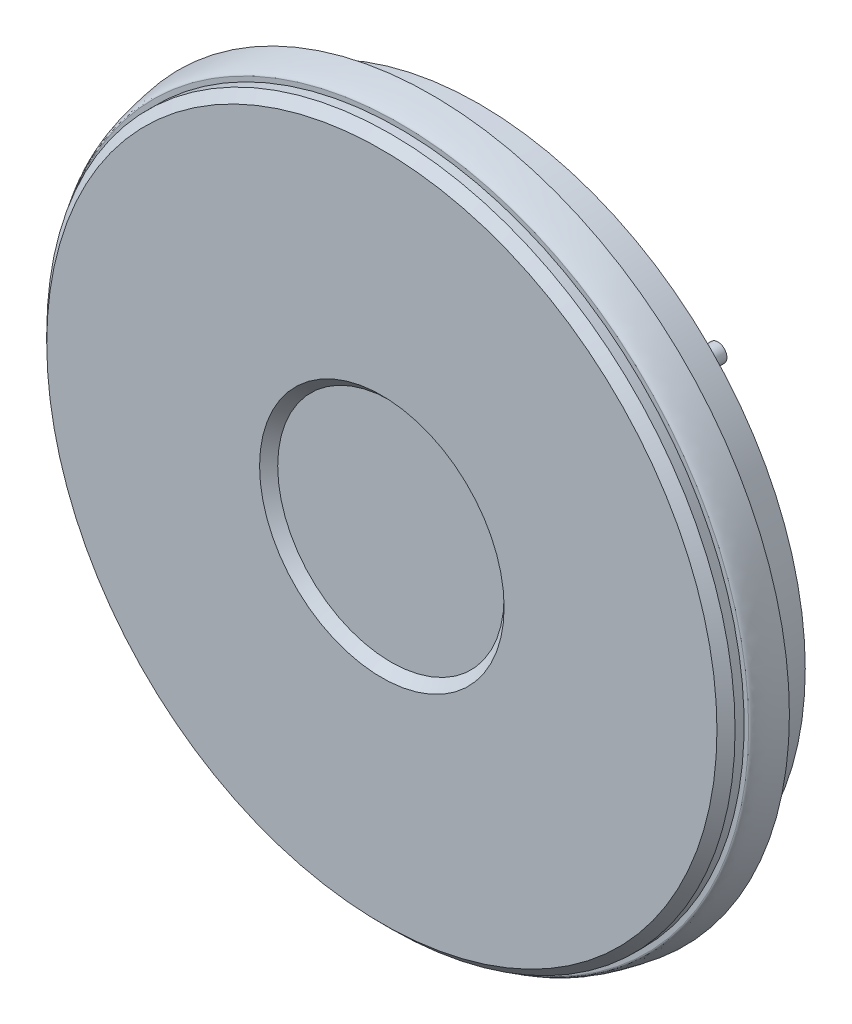
ISO-10303-21;
HEADER;
FILE_DESCRIPTION(('STEP AP214'),'2;1');
FILE_NAME('part.step','',(''),(''),'','','');
FILE_SCHEMA(('AUTOMOTIVE_DESIGN { 1 0 10303 214 1 1 1 1 }'));
ENDSEC;
DATA;
#1=APPLICATION_CONTEXT('core data for automotive mechanical design processes');
#2=APPLICATION_PROTOCOL_DEFINITION('international standard','automotive_design',2000,#1);
#3=PRODUCT_CONTEXT('',#1,'mechanical');
#4=PRODUCT('Part','Part','',(#3));
#5=PRODUCT_RELATED_PRODUCT_CATEGORY('part','',(#4));
#6=PRODUCT_DEFINITION_FORMATION('','',#4);
#7=PRODUCT_DEFINITION_CONTEXT('part definition',#1,'design');
#8=PRODUCT_DEFINITION('design','',#6,#7);
#9=PRODUCT_DEFINITION_SHAPE('','',#8);
#10=(LENGTH_UNIT() NAMED_UNIT(*) SI_UNIT(.MILLI.,.METRE.));
#11=(NAMED_UNIT(*) PLANE_ANGLE_UNIT() SI_UNIT($,.RADIAN.));
#12=(NAMED_UNIT(*) SI_UNIT($,.STERADIAN.) SOLID_ANGLE_UNIT());
#13=UNCERTAINTY_MEASURE_WITH_UNIT(LENGTH_MEASURE(1.E-05),#10,'distance_accuracy_value','');
#14=(GEOMETRIC_REPRESENTATION_CONTEXT(3) GLOBAL_UNCERTAINTY_ASSIGNED_CONTEXT((#13)) GLOBAL_UNIT_ASSIGNED_CONTEXT((#10,
#11,#12)) REPRESENTATION_CONTEXT('',''));
#15=CARTESIAN_POINT('',(0.,0.,0.));
#16=DIRECTION('',(0.,0.,1.));
#17=DIRECTION('',(1.,0.,0.));
#18=AXIS2_PLACEMENT_3D('',#15,#16,#17);
#19=CARTESIAN_POINT('',(0.,0.,-19.));
#20=DIRECTION('',(0.,0.,1.));
#21=DIRECTION('',(1.,0.,0.));
#22=AXIS2_PLACEMENT_3D('',#19,#20,#21);
#23=CONICAL_SURFACE('',#22,32.,1.38381705687599);
#24=CARTESIAN_POINT('',(0.,0.,-15.5));
#25=DIRECTION('',(0.,0.,1.));
#26=DIRECTION('',(1.,0.,0.));
#27=AXIS2_PLACEMENT_3D('',#24,#25,#26);
#28=CIRCLE('',#27,50.5);
#29=CARTESIAN_POINT('',(50.5,0.,-15.5));
#30=VERTEX_POINT('',#29);
#31=EDGE_CURVE('E120',#30,#30,#28,.T.);
#32=ORIENTED_EDGE('',*,*,#31,.F.);
#33=EDGE_LOOP('',(#32));
#34=FACE_BOUND('',#33,.T.);
#35=CARTESIAN_POINT('',(0.,0.,-19.));
#36=DIRECTION('',(0.,0.,1.));
#37=DIRECTION('',(1.,0.,0.));
#38=AXIS2_PLACEMENT_3D('',#35,#36,#37);
#39=CIRCLE('',#38,32.);
#40=CARTESIAN_POINT('',(32.,0.,-19.));
#41=VERTEX_POINT('',#40);
#42=EDGE_CURVE('E124',#41,#41,#39,.T.);
#43=ORIENTED_EDGE('',*,*,#42,.T.);
#44=EDGE_LOOP('',(#43));
#45=FACE_BOUND('',#44,.T.);
#46=CARTESIAN_POINT('',(27.7866084402661,25.9228494342572,-17.8646405768955));
#47=CARTESIAN_POINT('',(27.7083190812098,26.0010547407988,-17.8653774780036));
#48=CARTESIAN_POINT('',(27.6364715657968,26.0858409020205,-17.864282894545));
#49=CARTESIAN_POINT('',(27.5077822164449,26.266115598641,-17.858458398402));
#50=CARTESIAN_POINT('',(27.4509584465608,26.361616822822,-17.853724135962));
#51=CARTESIAN_POINT('',(27.3539841248708,26.5604267184576,-17.8407942703781));
#52=CARTESIAN_POINT('',(27.3138194338437,26.6637286807163,-17.8326016144773));
#53=CARTESIAN_POINT('',(27.2511243996395,26.8752297420599,-17.8130439344785));
#54=CARTESIAN_POINT('',(27.2285903748789,26.9834278137593,-17.8016795733594));
#55=CARTESIAN_POINT('',(27.2015031185621,27.2026059976347,-17.7760566879188));
#56=CARTESIAN_POINT('',(27.1970959486618,27.3136014855602,-17.7617756233053));
#57=CARTESIAN_POINT('',(27.2066166832189,27.5344700622705,-17.7308401857691));
#58=CARTESIAN_POINT('',(27.2205467481418,27.644343017263,-17.7141855333999));
#59=CARTESIAN_POINT('',(27.2666190527725,27.8619298269741,-17.678703328111));
#60=CARTESIAN_POINT('',(27.2990803020663,27.9695706955524,-17.6598424416512));
#61=CARTESIAN_POINT('',(27.3814209090786,28.1777065139437,-17.6207641323911));
#62=CARTESIAN_POINT('',(27.431301878724,28.2782008014145,-17.6005465841927));
#63=CARTESIAN_POINT('',(27.5479951482473,28.4709242398635,-17.5589979387498));
#64=CARTESIAN_POINT('',(27.6150725031688,28.5629902106871,-17.5376539935875));
#65=CARTESIAN_POINT('',(27.7638250314128,28.7344106329288,-17.4947768073707));
#66=CARTESIAN_POINT('',(27.8455010278453,28.8137643671188,-17.4732435557078));
#67=CARTESIAN_POINT('',(28.0218833542666,28.9581110631356,-17.430415230631));
#68=CARTESIAN_POINT('',(28.1166884553569,29.0229843857812,-17.4091234286395));
#69=CARTESIAN_POINT('',(28.3161622184946,29.1356486132857,-17.3675461252375));
#70=CARTESIAN_POINT('',(28.4208308780927,29.1834395223864,-17.3472606235772));
#71=CARTESIAN_POINT('',(28.636696277713,29.2603244897728,-17.3083232205729));
#72=CARTESIAN_POINT('',(28.7478692643724,29.2894824470505,-17.289665927709));
#73=CARTESIAN_POINT('',(28.9738855523762,29.3283677249349,-17.254421996244));
#74=CARTESIAN_POINT('',(29.0887286289065,29.3380962333982,-17.2378352311153));
#75=CARTESIAN_POINT('',(29.3172535121522,29.3376711586197,-17.2073909369241));
#76=CARTESIAN_POINT('',(29.4309314781242,29.3277692432189,-17.1935013355433));
#77=CARTESIAN_POINT('',(29.6552533904552,29.2887066495129,-17.1685774185538));
#78=CARTESIAN_POINT('',(29.7658976128995,29.2595477297878,-17.1575428423477));
#79=CARTESIAN_POINT('',(29.9790969723618,29.1833173019861,-17.1387933024743));
#80=CARTESIAN_POINT('',(30.081754037906,29.1365433072969,-17.1310275077409));
#81=CARTESIAN_POINT('',(30.2778977970352,29.0263137064449,-17.1187765613196));
#82=CARTESIAN_POINT('',(30.3713852345275,28.962859455046,-17.1142911433128));
#83=CARTESIAN_POINT('',(30.5452906629787,28.8219866812874,-17.1087623057145));
#84=CARTESIAN_POINT('',(30.6258609961733,28.7447578388738,-17.1076754480019));
#85=CARTESIAN_POINT('',(30.7730432459844,28.5780070259041,-17.1088506655149));
#86=CARTESIAN_POINT('',(30.8396557086932,28.4884855365165,-17.1111126096929));
#87=CARTESIAN_POINT('',(30.9567787809856,28.3001592247567,-17.1189052198412));
#88=CARTESIAN_POINT('',(31.0073604105273,28.2013979319644,-17.1244211497429));
#89=CARTESIAN_POINT('',(31.0914742593614,27.9970758987128,-17.138560126196));
#90=CARTESIAN_POINT('',(31.1250062414346,27.8915150636718,-17.1471832159759));
#91=CARTESIAN_POINT('',(31.1743271734831,27.6759960018385,-17.1673605804866));
#92=CARTESIAN_POINT('',(31.1900192926231,27.5660170999685,-17.178930438542));
#93=CARTESIAN_POINT('',(31.2030404694301,27.3452831324801,-17.204670893327));
#94=CARTESIAN_POINT('',(31.2003684306001,27.2345280209098,-17.218841645303));
#95=CARTESIAN_POINT('',(31.1767308459126,27.0138287475487,-17.2496165850547));
#96=CARTESIAN_POINT('',(31.1555246180017,26.9039145213503,-17.2662503881512));
#97=CARTESIAN_POINT('',(31.0952318507962,26.6894178796245,-17.3013713280528));
#98=CARTESIAN_POINT('',(31.0561438467192,26.5848359016677,-17.3198586165888));
#99=CARTESIAN_POINT('',(30.9605172484765,26.3822035252899,-17.3585128407818));
#100=CARTESIAN_POINT('',(30.9037097272945,26.2842842369309,-17.3787018995116));
#101=CARTESIAN_POINT('',(30.7745340144613,26.0995192192322,-17.4199572540222));
#102=CARTESIAN_POINT('',(30.7021645904359,26.0126743677647,-17.4410236191717));
#103=CARTESIAN_POINT('',(30.5429149967131,25.8514208503295,-17.4837307198298));
#104=CARTESIAN_POINT('',(30.4558654451106,25.7771804077686,-17.5053753406767));
#105=CARTESIAN_POINT('',(30.2703536753633,25.644562211581,-17.5483731259446));
#106=CARTESIAN_POINT('',(30.1718910114437,25.5861850778435,-17.569726278945));
#107=CARTESIAN_POINT('',(29.9659592594109,25.486826944053,-17.6115902807364));
#108=CARTESIAN_POINT('',(29.858461383683,25.4459042821164,-17.6320981010623));
#109=CARTESIAN_POINT('',(29.6377850170175,25.3830187592457,-17.6715688113388));
#110=CARTESIAN_POINT('',(29.5246069000162,25.3610546519783,-17.690531802772));
#111=CARTESIAN_POINT('',(29.296774904406,25.3369740850483,-17.726155538021));
#112=CARTESIAN_POINT('',(29.1821411816122,25.3346937639793,-17.7428341493018));
#113=CARTESIAN_POINT('',(28.9537796911399,25.349804578365,-17.7735204883676));
#114=CARTESIAN_POINT('',(28.8400520749999,25.3671989374702,-17.7875277780232));
#115=CARTESIAN_POINT('',(28.6187707688265,25.420875547504,-17.8121687081356));
#116=CARTESIAN_POINT('',(28.5111464578844,25.4568437031204,-17.822853857439));
#117=CARTESIAN_POINT('',(28.3033829493614,25.5465603942486,-17.8407643720016));
#118=CARTESIAN_POINT('',(28.2032337847799,25.6002847159501,-17.8479944162732));
#119=CARTESIAN_POINT('',(28.050429068569,25.6998142783417,-17.8566485680416));
#120=CARTESIAN_POINT('',(27.9944712400197,25.7405503245862,-17.8592372321324));
#121=CARTESIAN_POINT('',(27.8870388172195,25.8276163437418,-17.8630028304474));
#122=CARTESIAN_POINT('',(27.8355641760122,25.873946258051,-17.8641797794594));
#123=CARTESIAN_POINT('',(27.7866084402661,25.9228494342572,-17.8646405768955));
#124=B_SPLINE_CURVE_WITH_KNOTS('',3,(#46,#47,#48,#49,#50,#51,#52,#53,#54,#55,#56,#57,#58,#59,
#60,#61,#62,#63,#64,#65,#66,#67,#68,#69,#70,#71,#72,#73,#74,#75,#76,#77,#78,#79,#80,#81,#82,#83,
#84,#85,#86,#87,#88,#89,#90,#91,#92,#93,#94,#95,#96,#97,#98,#99,#100,#101,#102,#103,#104,#105,
#106,#107,#108,#109,#110,#111,#112,#113,#114,#115,#116,#117,#118,#119,#120,#121,#122,#123),
.UNSPECIFIED.,.T.,.F.,(4,2,2,2,2,2,2,2,2,2,2,2,2,2,2,2,2,2,2,2,2,2,2,2,2,2,2,2,2,2,2,2,2,2,2,2,
2,2,4),(0.,0.33172792330212,0.663852909851376,0.995695429053667,1.32746863537738,
1.66191001168749,1.99639079490754,2.33681111011882,2.67726293433675,3.0233159164112,
3.36938841602609,3.71822228497298,4.06705606729761,4.41468706271699,4.76229680439685,
5.10547890082227,5.44862966165093,5.78622725820314,6.12379744367805,6.45703501863238,
6.79025955345667,7.12198650117742,7.45371806423288,7.78724172289057,8.1207852959304,
8.45872566507467,8.79669372150201,9.14006351118342,9.4834605029376,9.83113118126698,
10.1788154435415,10.5276528346698,10.876467291521,11.2223751469364,11.5683396867598,
11.9086365333377,12.2484712239982,12.4559087974707,12.663344197997),.UNSPECIFIED.);
#125=CARTESIAN_POINT('',(27.7866084402661,25.9228494342572,-17.8646405768955));
#126=VERTEX_POINT('',#125);
#127=EDGE_CURVE('E58',#126,#126,#124,.T.);
#128=ORIENTED_EDGE('',*,*,#127,.F.);
#129=EDGE_LOOP('',(#128));
#130=FACE_BOUND('',#129,.T.);
#131=CARTESIAN_POINT('',(-30.5852798871474,25.8953187703622,-17.4722471263461));
#132=CARTESIAN_POINT('',(-30.6672718955883,25.97406134797,-17.4507823975966));
#133=CARTESIAN_POINT('',(-30.742610480517,26.0598800699168,-17.4294134516743));
#134=CARTESIAN_POINT('',(-30.8777458934135,26.2432759110166,-17.3874692878005));
#135=CARTESIAN_POINT('',(-30.937524199534,26.3408668426802,-17.3668950403737));
#136=CARTESIAN_POINT('',(-31.0396780299534,26.5450376640024,-17.32712039879));
#137=CARTESIAN_POINT('',(-31.0820543179401,26.6516171589502,-17.3079199443749));
#138=CARTESIAN_POINT('',(-31.1480355584359,26.8707197698036,-17.2714263012497));
#139=CARTESIAN_POINT('',(-31.1716458118558,26.9832411976853,-17.2541325751289));
#140=CARTESIAN_POINT('',(-31.1991433555308,27.2100012169761,-17.2220673808807));
#141=CARTESIAN_POINT('',(-31.2032023462947,27.3242159900423,-17.2072750599217));
#142=CARTESIAN_POINT('',(-31.1917724558806,27.5519959502675,-17.1804391353673));
#143=CARTESIAN_POINT('',(-31.1762844415918,27.6655611660092,-17.1683954099026));
#144=CARTESIAN_POINT('',(-31.1264706346823,27.8868552634448,-17.1475659721806));
#145=CARTESIAN_POINT('',(-31.0924520287164,27.9946486597728,-17.1387309450171));
#146=CARTESIAN_POINT('',(-31.006659196509,28.2031532100949,-17.1242968397996));
#147=CARTESIAN_POINT('',(-30.9548865469899,28.3038649920447,-17.1186974745074));
#148=CARTESIAN_POINT('',(-30.8358643519541,28.4938893419225,-17.1109458197951));
#149=CARTESIAN_POINT('',(-30.7688383319747,28.5833400826795,-17.1087470105581));
#150=CARTESIAN_POINT('',(-30.6208291536162,28.7498528845586,-17.1077098721091));
#151=CARTESIAN_POINT('',(-30.539846678661,28.8269155519466,-17.1088713783921));
#152=CARTESIAN_POINT('',(-30.366795462762,28.9660255359598,-17.1145051264063));
#153=CARTESIAN_POINT('',(-30.274797122501,29.028161300168,-17.1189571952254));
#154=CARTESIAN_POINT('',(-30.081964550566,29.1363183345191,-17.1310275887905));
#155=CARTESIAN_POINT('',(-29.9811302628387,29.1823395024251,-17.1386459336236));
#156=CARTESIAN_POINT('',(-29.77309954829,29.2572150077117,-17.1568790892304));
#157=CARTESIAN_POINT('',(-29.6658802824641,29.2860030741611,-17.1675052390371));
#158=CARTESIAN_POINT('',(-29.4484559650283,29.3254671578164,-17.1914588538452));
#159=CARTESIAN_POINT('',(-29.3382507566234,29.3361422220088,-17.2047864609421));
#160=CARTESIAN_POINT('',(-29.1165546105105,29.3392541296224,-17.2339717140859));
#161=CARTESIAN_POINT('',(-29.0050643607006,29.3314672627377,-17.249858197049));
#162=CARTESIAN_POINT('',(-28.7852196582652,29.2975620342683,-17.2836240674355));
#163=CARTESIAN_POINT('',(-28.6768654608675,29.2714421849963,-17.3015036164935));
#164=CARTESIAN_POINT('',(-28.4645354724592,29.2011611831812,-17.3390894110889));
#165=CARTESIAN_POINT('',(-28.360657033659,29.1567190243272,-17.3588202359826));
#166=CARTESIAN_POINT('',(-28.1619940270091,29.0511285879981,-17.3993351207904));
#167=CARTESIAN_POINT('',(-28.0672101901801,28.9899789691011,-17.420119265165));
#168=CARTESIAN_POINT('',(-27.8881060805226,28.8517875318501,-17.4624696004558));
#169=CARTESIAN_POINT('',(-27.8039439078648,28.7745427862472,-17.4840425537332));
#170=CARTESIAN_POINT('',(-27.6499506424541,28.6068641692175,-17.5270998337723));
#171=CARTESIAN_POINT('',(-27.5801202181297,28.5164296829615,-17.5485841563546));
#172=CARTESIAN_POINT('',(-27.4564695361268,28.3243989238345,-17.5909570710969));
#173=CARTESIAN_POINT('',(-27.4027325832986,28.2227481780492,-17.6118420741797));
#174=CARTESIAN_POINT('',(-27.3133721415553,28.0115212885549,-17.6522729780317));
#175=CARTESIAN_POINT('',(-27.2777483661682,27.9019452702206,-17.6718188999752));
#176=CARTESIAN_POINT('',(-27.2259455517807,27.6787017086687,-17.7088361859885));
#177=CARTESIAN_POINT('',(-27.2096441459022,27.5650646601023,-17.726319967016));
#178=CARTESIAN_POINT('',(-27.1967234831607,27.3363183006446,-17.7587797692949));
#179=CARTESIAN_POINT('',(-27.2001026173904,27.2212091108703,-17.7737559954389));
#180=CARTESIAN_POINT('',(-27.2264144958607,26.9947396473001,-17.8004661580753));
#181=CARTESIAN_POINT('',(-27.2490359199289,26.8833488685147,-17.8122477994154));
#182=CARTESIAN_POINT('',(-27.3129229488535,26.6657283287747,-17.8324599821448));
#183=CARTESIAN_POINT('',(-27.3541864660022,26.559497991383,-17.8408908985795));
#184=CARTESIAN_POINT('',(-27.4533373273899,26.3572628249284,-17.8539704329485));
#185=CARTESIAN_POINT('',(-27.510907746629,26.2611068328359,-17.8586852308681));
#186=CARTESIAN_POINT('',(-27.6413474682249,26.0796800106141,-17.8644129273951));
#187=CARTESIAN_POINT('',(-27.7142155681495,25.9944083258002,-17.865426116842));
#188=CARTESIAN_POINT('',(-27.872219820682,25.8381510418601,-17.8637236000176));
#189=CARTESIAN_POINT('',(-27.9572050145604,25.7670122184449,-17.8610507056449));
#190=CARTESIAN_POINT('',(-28.1376138526129,25.6397931920429,-17.852148976904));
#191=CARTESIAN_POINT('',(-28.2330374026161,25.5837128532196,-17.8459201746138));
#192=CARTESIAN_POINT('',(-28.4316856914452,25.4880590134438,-17.8301194210387));
#193=CARTESIAN_POINT('',(-28.5349183392334,25.4485025193269,-17.8205440438786));
#194=CARTESIAN_POINT('',(-28.7461749616846,25.3869503695901,-17.7983806956602));
#195=CARTESIAN_POINT('',(-28.8541990071977,25.364954973736,-17.7857926800422));
#196=CARTESIAN_POINT('',(-29.0734423419214,25.3388046355392,-17.7578404869086));
#197=CARTESIAN_POINT('',(-29.1846847873333,25.3348798066266,-17.7424430835216));
#198=CARTESIAN_POINT('',(-29.4059942070936,25.3454391873532,-17.7094697629773));
#199=CARTESIAN_POINT('',(-29.5160607747794,25.3599295702888,-17.6918931170597));
#200=CARTESIAN_POINT('',(-29.7340430706281,25.4072197843335,-17.654755621579));
#201=CARTESIAN_POINT('',(-29.8418803069002,25.4403563166076,-17.6351638599838));
#202=CARTESIAN_POINT('',(-30.0502060708383,25.5241246341899,-17.5948769874392));
#203=CARTESIAN_POINT('',(-30.150702407409,25.5747374907122,-17.5741830906499));
#204=CARTESIAN_POINT('',(-30.3071876818782,25.670770551937,-17.5398510252229));
#205=CARTESIAN_POINT('',(-30.3661553157224,25.7114786764563,-17.5263602519319));
#206=CARTESIAN_POINT('',(-30.479387925406,25.7989622521944,-17.4993160366215));
#207=CARTESIAN_POINT('',(-30.5336528507552,25.8457377685417,-17.4857625939309));
#208=CARTESIAN_POINT('',(-30.5852798871474,25.8953187703622,-17.4722471263461));
#209=B_SPLINE_CURVE_WITH_KNOTS('',3,(#131,#132,#133,#134,#135,#136,#137,#138,#139,#140,#141,
#142,#143,#144,#145,#146,#147,#148,#149,#150,#151,#152,#153,#154,#155,#156,#157,#158,#159,#160,
#161,#162,#163,#164,#165,#166,#167,#168,#169,#170,#171,#172,#173,#174,#175,#176,#177,#178,#179,
#180,#181,#182,#183,#184,#185,#186,#187,#188,#189,#190,#191,#192,#193,#194,#195,#196,#197,#198,
#199,#200,#201,#202,#203,#204,#205,#206,#207,#208),.UNSPECIFIED.,.T.,.F.,(4,2,2,2,2,2,2,2,2,2,2,
2,2,2,2,2,2,2,2,2,2,2,2,2,2,2,2,2,2,2,2,2,2,2,2,2,2,2,4),(0.,0.34680225552352,0.694015451272868,
1.0412134079406,1.38831325543411,1.7323592209238,2.07638992887026,2.41488381027249,
2.75334763808617,3.08713896757835,3.42091395652258,3.75265952288582,4.08440719392534,
4.41742255918689,4.750455445472,5.0875444041583,5.42466072014663,5.76715193499087,
6.10967065612856,6.45680200713026,6.80394954455792,7.15286414451347,7.50177322598297,
7.84846068606868,8.19511980444472,8.53627473923053,8.8773914779142,9.21228665896599,
9.54715552634944,9.87816765500918,10.2091767976453,10.5405257903614,10.8718796843405,
11.2074416292961,11.5431160937211,11.8850559882718,12.2266266799598,12.4449916255795,
12.6633589153587),.UNSPECIFIED.);
#210=CARTESIAN_POINT('',(-30.5852798871474,25.8953187703622,-17.4722471263461));
#211=VERTEX_POINT('',#210);
#212=EDGE_CURVE('E13',#211,#211,#209,.T.);
#213=ORIENTED_EDGE('',*,*,#212,.F.);
#214=EDGE_LOOP('',(#213));
#215=FACE_BOUND('',#214,.T.);
#216=ADVANCED_FACE('F47',(#34,#45,#130,#215),#23,.T.);
#217=CARTESIAN_POINT('',(0.,0.,4.));
#218=DIRECTION('',(0.,0.,-1.));
#219=DIRECTION('',(-1.,0.,0.));
#220=AXIS2_PLACEMENT_3D('',#217,#218,#219);
#221=CYLINDRICAL_SURFACE('',#220,76.);
#222=CARTESIAN_POINT('',(0.,0.,1.99999999999997));
#223=DIRECTION('',(0.,0.,1.));
#224=DIRECTION('',(1.,0.,0.));
#225=AXIS2_PLACEMENT_3D('',#222,#223,#224);
#226=CIRCLE('',#225,76.);
#227=CARTESIAN_POINT('',(76.,0.,1.99999999999997));
#228=VERTEX_POINT('',#227);
#229=EDGE_CURVE('E66',#228,#228,#226,.F.);
#230=ORIENTED_EDGE('',*,*,#229,.T.);
#231=EDGE_LOOP('',(#230));
#232=FACE_BOUND('',#231,.T.);
#233=CARTESIAN_POINT('',(0.,0.,0.));
#234=DIRECTION('',(0.,0.,-1.));
#235=DIRECTION('',(-1.,0.,0.));
#236=AXIS2_PLACEMENT_3D('',#233,#234,#235);
#237=CIRCLE('',#236,76.);
#238=CARTESIAN_POINT('',(-76.,0.,0.));
#239=VERTEX_POINT('',#238);
#240=EDGE_CURVE('E158',#239,#239,#237,.T.);
#241=ORIENTED_EDGE('',*,*,#240,.F.);
#242=EDGE_LOOP('',(#241));
#243=FACE_BOUND('',#242,.T.);
#244=ADVANCED_FACE('F109',(#232,#243),#221,.T.);
#245=CARTESIAN_POINT('',(0.,0.,4.));
#246=DIRECTION('',(0.,0.,1.));
#247=DIRECTION('',(1.,0.,0.));
#248=AXIS2_PLACEMENT_3D('',#245,#246,#247);
#249=PLANE('',#248);
#250=CARTESIAN_POINT('',(0.,0.,4.));
#251=DIRECTION('',(0.,0.,1.));
#252=DIRECTION('',(1.,0.,0.));
#253=AXIS2_PLACEMENT_3D('',#250,#251,#252);
#254=CIRCLE('',#253,27.);
#255=CARTESIAN_POINT('',(27.,0.,4.));
#256=VERTEX_POINT('',#255);
#257=EDGE_CURVE('E62',#256,#256,#254,.F.);
#258=ORIENTED_EDGE('',*,*,#257,.T.);
#259=EDGE_LOOP('',(#258));
#260=FACE_BOUND('',#259,.T.);
#261=CARTESIAN_POINT('',(0.,0.,4.));
#262=DIRECTION('',(0.,0.,1.));
#263=DIRECTION('',(1.,0.,0.));
#264=AXIS2_PLACEMENT_3D('',#261,#262,#263);
#265=CIRCLE('',#264,74.);
#266=CARTESIAN_POINT('',(74.,0.,4.));
#267=VERTEX_POINT('',#266);
#268=EDGE_CURVE('E164',#267,#267,#265,.T.);
#269=ORIENTED_EDGE('',*,*,#268,.T.);
#270=EDGE_LOOP('',(#269));
#271=FACE_BOUND('',#270,.T.);
#272=ADVANCED_FACE('F114',(#260,#271),#249,.T.);
#273=CARTESIAN_POINT('',(0.,0.,4.));
#274=DIRECTION('',(0.,0.,-1.));
#275=DIRECTION('',(-1.,0.,0.));
#276=AXIS2_PLACEMENT_3D('',#273,#274,#275);
#277=CONICAL_SURFACE('',#276,74.,0.785398163397445);
#278=ORIENTED_EDGE('',*,*,#229,.F.);
#279=EDGE_LOOP('',(#278));
#280=FACE_BOUND('',#279,.T.);
#281=ORIENTED_EDGE('',*,*,#268,.F.);
#282=EDGE_LOOP('',(#281));
#283=FACE_BOUND('',#282,.T.);
#284=ADVANCED_FACE('F170',(#280,#283),#277,.T.);
#285=CARTESIAN_POINT('',(0.,0.,2.));
#286=DIRECTION('',(0.,0.,1.));
#287=DIRECTION('',(1.,0.,0.));
#288=AXIS2_PLACEMENT_3D('',#285,#286,#287);
#289=PLANE('',#288);
#290=CARTESIAN_POINT('',(0.,0.,2.));
#291=DIRECTION('',(0.,0.,1.));
#292=DIRECTION('',(1.,0.,0.));
#293=AXIS2_PLACEMENT_3D('',#290,#291,#292);
#294=CIRCLE('',#293,25.);
#295=CARTESIAN_POINT('',(25.,0.,2.));
#296=VERTEX_POINT('',#295);
#297=EDGE_CURVE('E161',#296,#296,#294,.T.);
#298=ORIENTED_EDGE('',*,*,#297,.T.);
#299=EDGE_LOOP('',(#298));
#300=FACE_BOUND('',#299,.T.);
#301=ADVANCED_FACE('F173',(#300),#289,.T.);
#302=CARTESIAN_POINT('',(0.,0.,2.));
#303=DIRECTION('',(0.,0.,1.));
#304=DIRECTION('',(1.,0.,0.));
#305=AXIS2_PLACEMENT_3D('',#302,#303,#304);
#306=CONICAL_SURFACE('',#305,25.,0.785398163397447);
#307=ORIENTED_EDGE('',*,*,#257,.F.);
#308=EDGE_LOOP('',(#307));
#309=FACE_BOUND('',#308,.T.);
#310=ORIENTED_EDGE('',*,*,#297,.F.);
#311=EDGE_LOOP('',(#310));
#312=FACE_BOUND('',#311,.T.);
#313=ADVANCED_FACE('F49',(#309,#312),#306,.F.);
#314=CARTESIAN_POINT('',(-77.,0.,0.));
#315=DIRECTION('',(0.,0.,-1.));
#316=DIRECTION('',(-1.,0.,0.));
#317=AXIS2_PLACEMENT_3D('',#314,#315,#316);
#318=PLANE('',#317);
#319=ORIENTED_EDGE('',*,*,#240,.T.);
#320=EDGE_LOOP('',(#319));
#321=FACE_BOUND('',#320,.T.);
#322=CARTESIAN_POINT('',(0.,0.,0.));
#323=DIRECTION('',(0.,0.,1.));
#324=DIRECTION('',(1.,0.,0.));
#325=AXIS2_PLACEMENT_3D('',#322,#323,#324);
#326=CIRCLE('',#325,77.);
#327=CARTESIAN_POINT('',(77.,0.,0.));
#328=VERTEX_POINT('',#327);
#329=EDGE_CURVE('E155',#328,#328,#326,.T.);
#330=ORIENTED_EDGE('',*,*,#329,.T.);
#331=EDGE_LOOP('',(#330));
#332=FACE_BOUND('',#331,.T.);
#333=ADVANCED_FACE('F185',(#321,#332),#318,.F.);
#334=CARTESIAN_POINT('',(-79.,0.,-7.));
#335=CARTESIAN_POINT('',(-77.9384935860536,0.,0.));
#336=CARTESIAN_POINT('',(-77.,0.,0.));
#337=B_SPLINE_CURVE_WITH_KNOTS('',2,(#334,#335,#336),.UNSPECIFIED.,.F.,.F.,(3,3),(0.,1.),.UNSPECIFIED.);
#338=CARTESIAN_POINT('',(0.,0.,0.));
#339=DIRECTION('',(0.,0.,1.));
#340=AXIS1_PLACEMENT('',#338,#339);
#341=SURFACE_OF_REVOLUTION('',#337,#340);
#342=ORIENTED_EDGE('',*,*,#329,.F.);
#343=EDGE_LOOP('',(#342));
#344=FACE_BOUND('',#343,.T.);
#345=CARTESIAN_POINT('',(0.,0.,-7.));
#346=DIRECTION('',(0.,0.,1.));
#347=DIRECTION('',(1.,0.,0.));
#348=AXIS2_PLACEMENT_3D('',#345,#346,#347);
#349=CIRCLE('',#348,79.);
#350=CARTESIAN_POINT('',(79.,0.,-7.));
#351=VERTEX_POINT('',#350);
#352=EDGE_CURVE('E152',#351,#351,#349,.T.);
#353=ORIENTED_EDGE('',*,*,#352,.T.);
#354=EDGE_LOOP('',(#353));
#355=FACE_BOUND('',#354,.T.);
#356=ADVANCED_FACE('F188',(#344,#355),#341,.T.);
#357=CARTESIAN_POINT('',(-72.,0.,-7.));
#358=DIRECTION('',(0.,0.,1.));
#359=DIRECTION('',(1.,0.,0.));
#360=AXIS2_PLACEMENT_3D('',#357,#358,#359);
#361=PLANE('',#360);
#362=ORIENTED_EDGE('',*,*,#352,.F.);
#363=EDGE_LOOP('',(#362));
#364=FACE_BOUND('',#363,.T.);
#365=CARTESIAN_POINT('',(0.,0.,-7.));
#366=DIRECTION('',(0.,0.,1.));
#367=DIRECTION('',(1.,0.,0.));
#368=AXIS2_PLACEMENT_3D('',#365,#366,#367);
#369=CIRCLE('',#368,72.);
#370=CARTESIAN_POINT('',(72.,0.,-7.));
#371=VERTEX_POINT('',#370);
#372=EDGE_CURVE('E149',#371,#371,#369,.T.);
#373=ORIENTED_EDGE('',*,*,#372,.T.);
#374=EDGE_LOOP('',(#373));
#375=FACE_BOUND('',#374,.T.);
#376=ADVANCED_FACE('F192',(#364,#375),#361,.F.);
#377=CARTESIAN_POINT('',(0.,0.,0.));
#378=DIRECTION('',(0.,0.,1.));
#379=DIRECTION('',(1.,0.,0.));
#380=AXIS2_PLACEMENT_3D('',#377,#378,#379);
#381=CYLINDRICAL_SURFACE('',#380,72.);
#382=ORIENTED_EDGE('',*,*,#372,.F.);
#383=EDGE_LOOP('',(#382));
#384=FACE_BOUND('',#383,.T.);
#385=CARTESIAN_POINT('',(0.,0.,-17.5));
#386=DIRECTION('',(0.,0.,1.));
#387=DIRECTION('',(1.,0.,0.));
#388=AXIS2_PLACEMENT_3D('',#385,#386,#387);
#389=CIRCLE('',#388,72.);
#390=CARTESIAN_POINT('',(72.,0.,-17.5));
#391=VERTEX_POINT('',#390);
#392=EDGE_CURVE('E146',#391,#391,#389,.T.);
#393=ORIENTED_EDGE('',*,*,#392,.T.);
#394=EDGE_LOOP('',(#393));
#395=FACE_BOUND('',#394,.T.);
#396=ADVANCED_FACE('F196',(#384,#395),#381,.T.);
#397=CARTESIAN_POINT('',(-69.5,0.,-17.5));
#398=DIRECTION('',(0.,0.,1.));
#399=DIRECTION('',(1.,0.,0.));
#400=AXIS2_PLACEMENT_3D('',#397,#398,#399);
#401=PLANE('',#400);
#402=ORIENTED_EDGE('',*,*,#392,.F.);
#403=EDGE_LOOP('',(#402));
#404=FACE_BOUND('',#403,.T.);
#405=CARTESIAN_POINT('',(0.,0.,-17.5));
#406=DIRECTION('',(0.,0.,1.));
#407=DIRECTION('',(1.,0.,0.));
#408=AXIS2_PLACEMENT_3D('',#405,#406,#407);
#409=CIRCLE('',#408,69.5);
#410=CARTESIAN_POINT('',(69.5,0.,-17.5));
#411=VERTEX_POINT('',#410);
#412=EDGE_CURVE('E143',#411,#411,#409,.T.);
#413=ORIENTED_EDGE('',*,*,#412,.T.);
#414=EDGE_LOOP('',(#413));
#415=FACE_BOUND('',#414,.T.);
#416=ADVANCED_FACE('F200',(#404,#415),#401,.F.);
#417=CARTESIAN_POINT('',(0.,0.,0.));
#418=DIRECTION('',(0.,0.,1.));
#419=DIRECTION('',(1.,0.,0.));
#420=AXIS2_PLACEMENT_3D('',#417,#418,#419);
#421=CYLINDRICAL_SURFACE('',#420,69.5);
#422=ORIENTED_EDGE('',*,*,#412,.F.);
#423=EDGE_LOOP('',(#422));
#424=FACE_BOUND('',#423,.T.);
#425=CARTESIAN_POINT('',(0.,0.,-10.));
#426=DIRECTION('',(0.,0.,1.));
#427=DIRECTION('',(1.,0.,0.));
#428=AXIS2_PLACEMENT_3D('',#425,#426,#427);
#429=CIRCLE('',#428,69.5);
#430=CARTESIAN_POINT('',(69.5,0.,-10.));
#431=VERTEX_POINT('',#430);
#432=EDGE_CURVE('E140',#431,#431,#429,.T.);
#433=ORIENTED_EDGE('',*,*,#432,.T.);
#434=EDGE_LOOP('',(#433));
#435=FACE_BOUND('',#434,.T.);
#436=ADVANCED_FACE('F204',(#424,#435),#421,.F.);
#437=CARTESIAN_POINT('',(-57.5,0.,-10.));
#438=DIRECTION('',(0.,0.,1.));
#439=DIRECTION('',(1.,0.,0.));
#440=AXIS2_PLACEMENT_3D('',#437,#438,#439);
#441=PLANE('',#440);
#442=ORIENTED_EDGE('',*,*,#432,.F.);
#443=EDGE_LOOP('',(#442));
#444=FACE_BOUND('',#443,.T.);
#445=CARTESIAN_POINT('',(0.,0.,-10.));
#446=DIRECTION('',(0.,0.,1.));
#447=DIRECTION('',(1.,0.,0.));
#448=AXIS2_PLACEMENT_3D('',#445,#446,#447);
#449=CIRCLE('',#448,57.5);
#450=CARTESIAN_POINT('',(57.5,0.,-10.));
#451=VERTEX_POINT('',#450);
#452=EDGE_CURVE('E128',#451,#451,#449,.T.);
#453=ORIENTED_EDGE('',*,*,#452,.T.);
#454=EDGE_LOOP('',(#453));
#455=FACE_BOUND('',#454,.T.);
#456=ADVANCED_FACE('F104',(#444,#455),#441,.F.);
#457=CARTESIAN_POINT('',(0.,0.,-15.5));
#458=DIRECTION('',(0.,0.,1.));
#459=DIRECTION('',(1.,0.,0.));
#460=AXIS2_PLACEMENT_3D('',#457,#458,#459);
#461=CONICAL_SURFACE('',#460,50.5,0.904827089415787);
#462=ORIENTED_EDGE('',*,*,#452,.F.);
#463=EDGE_LOOP('',(#462));
#464=FACE_BOUND('',#463,.T.);
#465=ORIENTED_EDGE('',*,*,#31,.T.);
#466=EDGE_LOOP('',(#465));
#467=FACE_BOUND('',#466,.T.);
#468=ADVANCED_FACE('F99',(#464,#467),#461,.T.);
#469=CARTESIAN_POINT('',(0.,0.,-19.));
#470=DIRECTION('',(0.,0.,1.));
#471=DIRECTION('',(1.,0.,0.));
#472=AXIS2_PLACEMENT_3D('',#469,#470,#471);
#473=PLANE('',#472);
#474=CARTESIAN_POINT('',(0.,0.,-19.));
#475=DIRECTION('',(0.,0.,-1.));
#476=DIRECTION('',(-1.,0.,0.));
#477=AXIS2_PLACEMENT_3D('',#474,#475,#476);
#478=CIRCLE('',#477,5.49999999999999);
#479=CARTESIAN_POINT('',(-5.49999999999999,0.,-19.));
#480=VERTEX_POINT('',#479);
#481=EDGE_CURVE('E126',#480,#480,#478,.T.);
#482=ORIENTED_EDGE('',*,*,#481,.F.);
#483=EDGE_LOOP('',(#482));
#484=FACE_BOUND('',#483,.T.);
#485=ORIENTED_EDGE('',*,*,#42,.F.);
#486=EDGE_LOOP('',(#485));
#487=FACE_BOUND('',#486,.T.);
#488=ADVANCED_FACE('F96',(#484,#487),#473,.F.);
#489=CARTESIAN_POINT('',(0.,0.,-51.));
#490=DIRECTION('',(0.,0.,-1.));
#491=DIRECTION('',(-1.,0.,0.));
#492=AXIS2_PLACEMENT_3D('',#489,#490,#491);
#493=CYLINDRICAL_SURFACE('',#492,5.49999999999999);
#494=ORIENTED_EDGE('',*,*,#481,.T.);
#495=EDGE_LOOP('',(#494));
#496=FACE_BOUND('',#495,.T.);
#497=CARTESIAN_POINT('',(0.,0.,-23.));
#498=DIRECTION('',(0.,0.,-1.));
#499=DIRECTION('',(-1.,0.,0.));
#500=AXIS2_PLACEMENT_3D('',#497,#498,#499);
#501=CIRCLE('',#500,5.49999999999999);
#502=CARTESIAN_POINT('',(-5.49999999999999,0.,-23.));
#503=VERTEX_POINT('',#502);
#504=EDGE_CURVE('E131',#503,#503,#501,.T.);
#505=ORIENTED_EDGE('',*,*,#504,.F.);
#506=EDGE_LOOP('',(#505));
#507=FACE_BOUND('',#506,.T.);
#508=ADVANCED_FACE('F93',(#496,#507),#493,.T.);
#509=CARTESIAN_POINT('',(-5.49999999999999,0.,-23.));
#510=DIRECTION('',(0.,0.,-1.));
#511=DIRECTION('',(-1.,0.,0.));
#512=AXIS2_PLACEMENT_3D('',#509,#510,#511);
#513=PLANE('',#512);
#514=ORIENTED_EDGE('',*,*,#504,.T.);
#515=EDGE_LOOP('',(#514));
#516=FACE_BOUND('',#515,.T.);
#517=CARTESIAN_POINT('',(0.,0.,-23.));
#518=DIRECTION('',(0.,0.,-1.));
#519=DIRECTION('',(-1.,0.,0.));
#520=AXIS2_PLACEMENT_3D('',#517,#518,#519);
#521=CIRCLE('',#520,3.);
#522=CARTESIAN_POINT('',(-3.,0.,-23.));
#523=VERTEX_POINT('',#522);
#524=EDGE_CURVE('E306',#523,#523,#521,.T.);
#525=ORIENTED_EDGE('',*,*,#524,.F.);
#526=EDGE_LOOP('',(#525));
#527=FACE_BOUND('',#526,.T.);
#528=ADVANCED_FACE('F89',(#516,#527),#513,.T.);
#529=CARTESIAN_POINT('',(0.,0.,-51.));
#530=DIRECTION('',(0.,0.,-1.));
#531=DIRECTION('',(-1.,0.,0.));
#532=AXIS2_PLACEMENT_3D('',#529,#530,#531);
#533=CYLINDRICAL_SURFACE('',#532,3.);
#534=ORIENTED_EDGE('',*,*,#524,.T.);
#535=EDGE_LOOP('',(#534));
#536=FACE_BOUND('',#535,.T.);
#537=CARTESIAN_POINT('',(0.,0.,-51.));
#538=DIRECTION('',(0.,0.,-1.));
#539=DIRECTION('',(-1.,0.,0.));
#540=AXIS2_PLACEMENT_3D('',#537,#538,#539);
#541=CIRCLE('',#540,3.);
#542=CARTESIAN_POINT('',(-3.,0.,-51.));
#543=VERTEX_POINT('',#542);
#544=EDGE_CURVE('E301',#543,#543,#541,.T.);
#545=ORIENTED_EDGE('',*,*,#544,.F.);
#546=EDGE_LOOP('',(#545));
#547=FACE_BOUND('',#546,.T.);
#548=ADVANCED_FACE('F85',(#536,#547),#533,.T.);
#549=CARTESIAN_POINT('',(-3.,0.,-51.));
#550=DIRECTION('',(0.,0.,-1.));
#551=DIRECTION('',(-1.,0.,0.));
#552=AXIS2_PLACEMENT_3D('',#549,#550,#551);
#553=PLANE('',#552);
#554=ORIENTED_EDGE('',*,*,#544,.T.);
#555=EDGE_LOOP('',(#554));
#556=FACE_BOUND('',#555,.T.);
#557=ADVANCED_FACE('F81',(#556),#553,.T.);
#558=CARTESIAN_POINT('',(29.2,27.3378857997468,-91.6568542494924));
#559=DIRECTION('',(0.,0.,1.));
#560=DIRECTION('',(1.,0.,0.));
#561=AXIS2_PLACEMENT_3D('',#558,#559,#560);
#562=CYLINDRICAL_SURFACE('',#561,2.00000000000001);
#563=CARTESIAN_POINT('',(29.2,27.3378857997468,-41.));
#564=DIRECTION('',(0.,0.,1.));
#565=DIRECTION('',(1.,0.,0.));
#566=AXIS2_PLACEMENT_3D('',#563,#564,#565);
#567=CIRCLE('',#566,2.00000000000001);
#568=CARTESIAN_POINT('',(31.2,27.3378857997468,-41.));
#569=VERTEX_POINT('',#568);
#570=EDGE_CURVE('E298',#569,#569,#567,.T.);
#571=ORIENTED_EDGE('',*,*,#570,.T.);
#572=EDGE_LOOP('',(#571));
#573=FACE_BOUND('',#572,.T.);
#574=ORIENTED_EDGE('',*,*,#127,.T.);
#575=EDGE_LOOP('',(#574));
#576=FACE_BOUND('',#575,.T.);
#577=ADVANCED_FACE('F75',(#573,#576),#562,.T.);
#578=CARTESIAN_POINT('',(0.,0.,-41.));
#579=DIRECTION('',(0.,0.,1.));
#580=DIRECTION('',(1.,0.,0.));
#581=AXIS2_PLACEMENT_3D('',#578,#579,#580);
#582=PLANE('',#581);
#583=ORIENTED_EDGE('',*,*,#570,.F.);
#584=EDGE_LOOP('',(#583));
#585=FACE_BOUND('',#584,.T.);
#586=ADVANCED_FACE('F80',(#585),#582,.F.);
#587=CARTESIAN_POINT('',(-29.2,27.3378857997468,-91.6568542494924));
#588=DIRECTION('',(0.,0.,1.));
#589=DIRECTION('',(1.,0.,0.));
#590=AXIS2_PLACEMENT_3D('',#587,#588,#589);
#591=CYLINDRICAL_SURFACE('',#590,2.00000000000001);
#592=CARTESIAN_POINT('',(-29.2,27.3378857997468,-41.));
#593=DIRECTION('',(0.,0.,1.));
#594=DIRECTION('',(1.,0.,0.));
#595=AXIS2_PLACEMENT_3D('',#592,#593,#594);
#596=CIRCLE('',#595,2.00000000000001);
#597=CARTESIAN_POINT('',(-27.2,27.3378857997468,-41.));
#598=VERTEX_POINT('',#597);
#599=EDGE_CURVE('E297',#598,#598,#596,.T.);
#600=ORIENTED_EDGE('',*,*,#599,.T.);
#601=EDGE_LOOP('',(#600));
#602=FACE_BOUND('',#601,.T.);
#603=ORIENTED_EDGE('',*,*,#212,.T.);
#604=EDGE_LOOP('',(#603));
#605=FACE_BOUND('',#604,.T.);
#606=ADVANCED_FACE('F272',(#602,#605),#591,.T.);
#607=CARTESIAN_POINT('',(0.,0.,-41.));
#608=DIRECTION('',(0.,0.,1.));
#609=DIRECTION('',(1.,0.,0.));
#610=AXIS2_PLACEMENT_3D('',#607,#608,#609);
#611=PLANE('',#610);
#612=ORIENTED_EDGE('',*,*,#599,.F.);
#613=EDGE_LOOP('',(#612));
#614=FACE_BOUND('',#613,.T.);
#615=ADVANCED_FACE('F281',(#614),#611,.F.);
#616=CLOSED_SHELL('',(#216,#244,#272,#284,#301,#313,#333,#356,#376,#396,#416,#436,#456,#468,
#488,#508,#528,#548,#557,#577,#586,#606,#615));
#617=MANIFOLD_SOLID_BREP('B2',#616);
#618=ADVANCED_BREP_SHAPE_REPRESENTATION('',(#18,#617),#14);
#619=SHAPE_DEFINITION_REPRESENTATION(#9,#618);
ENDSEC;
END-ISO-10303-21;
